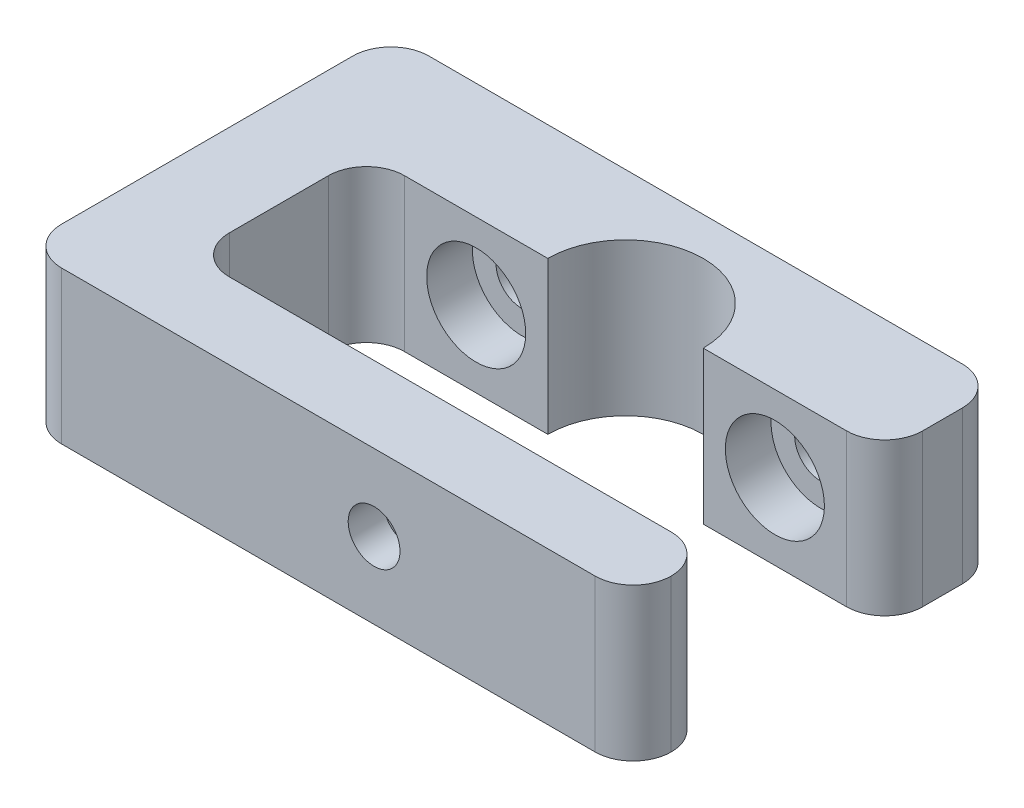
ISO-10303-21;
HEADER;
FILE_DESCRIPTION(('STEP AP214'),'2;1');
FILE_NAME('part.step','',(''),(''),'','','');
FILE_SCHEMA(('AUTOMOTIVE_DESIGN { 1 0 10303 214 1 1 1 1 }'));
ENDSEC;
DATA;
#1=APPLICATION_CONTEXT('core data for automotive mechanical design processes');
#2=APPLICATION_PROTOCOL_DEFINITION('international standard','automotive_design',2000,#1);
#3=PRODUCT_CONTEXT('',#1,'mechanical');
#4=PRODUCT('Part','Part','',(#3));
#5=PRODUCT_RELATED_PRODUCT_CATEGORY('part','',(#4));
#6=PRODUCT_DEFINITION_FORMATION('','',#4);
#7=PRODUCT_DEFINITION_CONTEXT('part definition',#1,'design');
#8=PRODUCT_DEFINITION('design','',#6,#7);
#9=PRODUCT_DEFINITION_SHAPE('','',#8);
#10=(LENGTH_UNIT() NAMED_UNIT(*) SI_UNIT(.MILLI.,.METRE.));
#11=(NAMED_UNIT(*) PLANE_ANGLE_UNIT() SI_UNIT($,.RADIAN.));
#12=(NAMED_UNIT(*) SI_UNIT($,.STERADIAN.) SOLID_ANGLE_UNIT());
#13=UNCERTAINTY_MEASURE_WITH_UNIT(LENGTH_MEASURE(1.E-05),#10,'distance_accuracy_value','');
#14=(GEOMETRIC_REPRESENTATION_CONTEXT(3) GLOBAL_UNCERTAINTY_ASSIGNED_CONTEXT((#13)) GLOBAL_UNIT_ASSIGNED_CONTEXT((#10,
#11,#12)) REPRESENTATION_CONTEXT('',''));
#15=CARTESIAN_POINT('',(0.,0.,0.));
#16=DIRECTION('',(0.,0.,1.));
#17=DIRECTION('',(1.,0.,0.));
#18=AXIS2_PLACEMENT_3D('',#15,#16,#17);
#19=CARTESIAN_POINT('',(0.,10.,0.));
#20=DIRECTION('',(0.,-1.,0.));
#21=DIRECTION('',(0.,0.,-1.));
#22=AXIS2_PLACEMENT_3D('',#19,#20,#21);
#23=CYLINDRICAL_SURFACE('',#22,5.1);
#24=CARTESIAN_POINT('',(0.,0.,0.));
#25=DIRECTION('',(0.,-1.,0.));
#26=DIRECTION('',(0.,0.,1.));
#27=AXIS2_PLACEMENT_3D('',#24,#25,#26);
#28=CIRCLE('',#27,5.1);
#29=CARTESIAN_POINT('',(-5.1,0.,0.));
#30=VERTEX_POINT('',#29);
#31=CARTESIAN_POINT('',(5.1,0.,0.));
#32=VERTEX_POINT('',#31);
#33=EDGE_CURVE('E277',#30,#32,#28,.T.);
#34=ORIENTED_EDGE('',*,*,#33,.T.);
#35=DIRECTION('',(0.,-1.,0.));
#36=VECTOR('',#35,1.);
#37=CARTESIAN_POINT('',(5.1,10.,0.));
#38=LINE('',#37,#36);
#39=CARTESIAN_POINT('',(5.1,10.,0.));
#40=VERTEX_POINT('',#39);
#41=EDGE_CURVE('E304',#40,#32,#38,.T.);
#42=ORIENTED_EDGE('',*,*,#41,.F.);
#43=CARTESIAN_POINT('',(0.,10.,0.));
#44=DIRECTION('',(0.,-1.,0.));
#45=DIRECTION('',(0.,0.,1.));
#46=AXIS2_PLACEMENT_3D('',#43,#44,#45);
#47=CIRCLE('',#46,5.1);
#48=CARTESIAN_POINT('',(-5.1,10.,0.));
#49=VERTEX_POINT('',#48);
#50=EDGE_CURVE('E250',#49,#40,#47,.T.);
#51=ORIENTED_EDGE('',*,*,#50,.F.);
#52=DIRECTION('',(0.,-1.,0.));
#53=VECTOR('',#52,1.);
#54=CARTESIAN_POINT('',(-5.1,10.,0.));
#55=LINE('',#54,#53);
#56=EDGE_CURVE('E276',#49,#30,#55,.T.);
#57=ORIENTED_EDGE('',*,*,#56,.T.);
#58=EDGE_LOOP('',(#34,#42,#51,#57));
#59=FACE_BOUND('',#58,.T.);
#60=ADVANCED_FACE('F37',(#59),#23,.F.);
#61=CARTESIAN_POINT('',(5.1,10.,0.));
#62=DIRECTION('',(0.,0.,-1.));
#63=DIRECTION('',(-1.,0.,0.));
#64=AXIS2_PLACEMENT_3D('',#61,#62,#63);
#65=PLANE('',#64);
#66=CARTESIAN_POINT('',(9.8,5.,0.));
#67=DIRECTION('',(0.,0.,1.));
#68=DIRECTION('',(1.,0.,0.));
#69=AXIS2_PLACEMENT_3D('',#66,#67,#68);
#70=CIRCLE('',#69,3.25);
#71=CARTESIAN_POINT('',(13.05,5.,0.));
#72=VERTEX_POINT('',#71);
#73=EDGE_CURVE('E823',#72,#72,#70,.T.);
#74=ORIENTED_EDGE('',*,*,#73,.F.);
#75=EDGE_LOOP('',(#74));
#76=FACE_BOUND('',#75,.T.);
#77=DIRECTION('',(1.,0.,0.));
#78=VECTOR('',#77,1.);
#79=CARTESIAN_POINT('',(5.1,0.,0.));
#80=LINE('',#79,#78);
#81=CARTESIAN_POINT('',(14.5,0.,0.));
#82=VERTEX_POINT('',#81);
#83=EDGE_CURVE('E280',#32,#82,#80,.T.);
#84=ORIENTED_EDGE('',*,*,#83,.T.);
#85=DIRECTION('',(0.,-1.,0.));
#86=VECTOR('',#85,1.);
#87=CARTESIAN_POINT('',(14.5,10.,0.));
#88=LINE('',#87,#86);
#89=CARTESIAN_POINT('',(14.5,10.,0.));
#90=VERTEX_POINT('',#89);
#91=EDGE_CURVE('E364',#82,#90,#88,.F.);
#92=ORIENTED_EDGE('',*,*,#91,.T.);
#93=DIRECTION('',(1.,0.,0.));
#94=VECTOR('',#93,1.);
#95=CARTESIAN_POINT('',(5.1,10.,0.));
#96=LINE('',#95,#94);
#97=EDGE_CURVE('E253',#40,#90,#96,.T.);
#98=ORIENTED_EDGE('',*,*,#97,.F.);
#99=ORIENTED_EDGE('',*,*,#41,.T.);
#100=EDGE_LOOP('',(#84,#92,#98,#99));
#101=FACE_BOUND('',#100,.T.);
#102=ADVANCED_FACE('F453',(#76,#101),#65,.F.);
#103=CARTESIAN_POINT('',(17.,10.,0.));
#104=DIRECTION('',(-1.,0.,0.));
#105=DIRECTION('',(0.,0.,1.));
#106=AXIS2_PLACEMENT_3D('',#103,#104,#105);
#107=PLANE('',#106);
#108=DIRECTION('',(0.,0.,-1.));
#109=VECTOR('',#108,1.);
#110=CARTESIAN_POINT('',(17.,10.,0.));
#111=LINE('',#110,#109);
#112=CARTESIAN_POINT('',(17.,10.,-2.5));
#113=VERTEX_POINT('',#112);
#114=CARTESIAN_POINT('',(17.,10.,-5.1));
#115=VERTEX_POINT('',#114);
#116=EDGE_CURVE('E257',#113,#115,#111,.T.);
#117=ORIENTED_EDGE('',*,*,#116,.F.);
#118=DIRECTION('',(0.,-1.,0.));
#119=VECTOR('',#118,1.);
#120=CARTESIAN_POINT('',(17.,10.,-2.5));
#121=LINE('',#120,#119);
#122=CARTESIAN_POINT('',(17.,0.,-2.5));
#123=VERTEX_POINT('',#122);
#124=EDGE_CURVE('E361',#113,#123,#121,.T.);
#125=ORIENTED_EDGE('',*,*,#124,.T.);
#126=DIRECTION('',(0.,0.,-1.));
#127=VECTOR('',#126,1.);
#128=CARTESIAN_POINT('',(17.,0.,0.));
#129=LINE('',#128,#127);
#130=CARTESIAN_POINT('',(17.,0.,-5.1));
#131=VERTEX_POINT('',#130);
#132=EDGE_CURVE('E283',#123,#131,#129,.T.);
#133=ORIENTED_EDGE('',*,*,#132,.T.);
#134=DIRECTION('',(0.,-1.,0.));
#135=VECTOR('',#134,1.);
#136=CARTESIAN_POINT('',(17.,10.,-5.1));
#137=LINE('',#136,#135);
#138=EDGE_CURVE('E359',#131,#115,#137,.F.);
#139=ORIENTED_EDGE('',*,*,#138,.T.);
#140=EDGE_LOOP('',(#117,#125,#133,#139));
#141=FACE_BOUND('',#140,.T.);
#142=ADVANCED_FACE('F409',(#141),#107,.F.);
#143=CARTESIAN_POINT('',(17.,10.,-7.6));
#144=DIRECTION('',(0.,0.,1.));
#145=DIRECTION('',(1.,0.,0.));
#146=AXIS2_PLACEMENT_3D('',#143,#144,#145);
#147=PLANE('',#146);
#148=CARTESIAN_POINT('',(-9.79999999999999,5.,-7.6));
#149=DIRECTION('',(0.,0.,1.));
#150=DIRECTION('',(1.,0.,0.));
#151=AXIS2_PLACEMENT_3D('',#148,#149,#150);
#152=CIRCLE('',#151,1.7);
#153=CARTESIAN_POINT('',(-8.1,5.,-7.6));
#154=VERTEX_POINT('',#153);
#155=EDGE_CURVE('E820',#154,#154,#152,.T.);
#156=ORIENTED_EDGE('',*,*,#155,.T.);
#157=EDGE_LOOP('',(#156));
#158=FACE_BOUND('',#157,.T.);
#159=CARTESIAN_POINT('',(9.8,5.,-7.6));
#160=DIRECTION('',(0.,0.,1.));
#161=DIRECTION('',(1.,0.,0.));
#162=AXIS2_PLACEMENT_3D('',#159,#160,#161);
#163=CIRCLE('',#162,1.7);
#164=CARTESIAN_POINT('',(11.5,5.,-7.6));
#165=VERTEX_POINT('',#164);
#166=EDGE_CURVE('E220',#165,#165,#163,.T.);
#167=ORIENTED_EDGE('',*,*,#166,.T.);
#168=EDGE_LOOP('',(#167));
#169=FACE_BOUND('',#168,.T.);
#170=DIRECTION('',(-1.,0.,0.));
#171=VECTOR('',#170,1.);
#172=CARTESIAN_POINT('',(17.,0.,-7.6));
#173=LINE('',#172,#171);
#174=CARTESIAN_POINT('',(14.5,0.,-7.6));
#175=VERTEX_POINT('',#174);
#176=CARTESIAN_POINT('',(-20.5,0.,-7.6));
#177=VERTEX_POINT('',#176);
#178=EDGE_CURVE('E286',#175,#177,#173,.T.);
#179=ORIENTED_EDGE('',*,*,#178,.T.);
#180=DIRECTION('',(0.,-1.,0.));
#181=VECTOR('',#180,1.);
#182=CARTESIAN_POINT('',(-20.5,10.,-7.6));
#183=LINE('',#182,#181);
#184=CARTESIAN_POINT('',(-20.5,10.,-7.6));
#185=VERTEX_POINT('',#184);
#186=EDGE_CURVE('E327',#177,#185,#183,.F.);
#187=ORIENTED_EDGE('',*,*,#186,.T.);
#188=DIRECTION('',(-1.,0.,0.));
#189=VECTOR('',#188,1.);
#190=CARTESIAN_POINT('',(17.,10.,-7.6));
#191=LINE('',#190,#189);
#192=CARTESIAN_POINT('',(14.5,10.,-7.6));
#193=VERTEX_POINT('',#192);
#194=EDGE_CURVE('E260',#193,#185,#191,.T.);
#195=ORIENTED_EDGE('',*,*,#194,.F.);
#196=DIRECTION('',(0.,-1.,0.));
#197=VECTOR('',#196,1.);
#198=CARTESIAN_POINT('',(14.5,10.,-7.6));
#199=LINE('',#198,#197);
#200=EDGE_CURVE('E324',#193,#175,#199,.T.);
#201=ORIENTED_EDGE('',*,*,#200,.T.);
#202=EDGE_LOOP('',(#179,#187,#195,#201));
#203=FACE_BOUND('',#202,.T.);
#204=ADVANCED_FACE('F417',(#158,#169,#203),#147,.F.);
#205=CARTESIAN_POINT('',(-23.,10.,16.5));
#206=DIRECTION('',(1.,0.,0.));
#207=DIRECTION('',(0.,0.,-1.));
#208=AXIS2_PLACEMENT_3D('',#205,#206,#207);
#209=PLANE('',#208);
#210=DIRECTION('',(0.,0.,1.));
#211=VECTOR('',#210,1.);
#212=CARTESIAN_POINT('',(-23.,10.,16.5));
#213=LINE('',#212,#211);
#214=CARTESIAN_POINT('',(-23.,10.,-5.1));
#215=VERTEX_POINT('',#214);
#216=CARTESIAN_POINT('',(-23.,10.,14.));
#217=VERTEX_POINT('',#216);
#218=EDGE_CURVE('E263',#215,#217,#213,.T.);
#219=ORIENTED_EDGE('',*,*,#218,.F.);
#220=DIRECTION('',(0.,-1.,0.));
#221=VECTOR('',#220,1.);
#222=CARTESIAN_POINT('',(-23.,10.,-5.1));
#223=LINE('',#222,#221);
#224=CARTESIAN_POINT('',(-23.,0.,-5.1));
#225=VERTEX_POINT('',#224);
#226=EDGE_CURVE('E309',#215,#225,#223,.T.);
#227=ORIENTED_EDGE('',*,*,#226,.T.);
#228=DIRECTION('',(0.,0.,1.));
#229=VECTOR('',#228,1.);
#230=CARTESIAN_POINT('',(-23.,0.,16.5));
#231=LINE('',#230,#229);
#232=CARTESIAN_POINT('',(-23.,0.,14.));
#233=VERTEX_POINT('',#232);
#234=EDGE_CURVE('E289',#225,#233,#231,.T.);
#235=ORIENTED_EDGE('',*,*,#234,.T.);
#236=DIRECTION('',(0.,-1.,0.));
#237=VECTOR('',#236,1.);
#238=CARTESIAN_POINT('',(-23.,10.,14.));
#239=LINE('',#238,#237);
#240=EDGE_CURVE('E307',#233,#217,#239,.F.);
#241=ORIENTED_EDGE('',*,*,#240,.T.);
#242=EDGE_LOOP('',(#219,#227,#235,#241));
#243=FACE_BOUND('',#242,.T.);
#244=ADVANCED_FACE('F425',(#243),#209,.F.);
#245=CARTESIAN_POINT('',(17.,10.,16.5));
#246=DIRECTION('',(0.,0.,-1.));
#247=DIRECTION('',(-1.,0.,0.));
#248=AXIS2_PLACEMENT_3D('',#245,#246,#247);
#249=PLANE('',#248);
#250=CARTESIAN_POINT('',(0.,5.,16.5));
#251=DIRECTION('',(0.,0.,-1.));
#252=DIRECTION('',(-1.,0.,0.));
#253=AXIS2_PLACEMENT_3D('',#250,#251,#252);
#254=CIRCLE('',#253,1.7);
#255=CARTESIAN_POINT('',(-1.7,5.,16.5));
#256=VERTEX_POINT('',#255);
#257=EDGE_CURVE('E804',#256,#256,#254,.T.);
#258=ORIENTED_EDGE('',*,*,#257,.T.);
#259=EDGE_LOOP('',(#258));
#260=FACE_BOUND('',#259,.T.);
#261=DIRECTION('',(1.,0.,0.));
#262=VECTOR('',#261,1.);
#263=CARTESIAN_POINT('',(17.,10.,16.5));
#264=LINE('',#263,#262);
#265=CARTESIAN_POINT('',(-20.5,10.,16.5));
#266=VERTEX_POINT('',#265);
#267=CARTESIAN_POINT('',(14.5,10.,16.5));
#268=VERTEX_POINT('',#267);
#269=EDGE_CURVE('E266',#266,#268,#264,.T.);
#270=ORIENTED_EDGE('',*,*,#269,.F.);
#271=DIRECTION('',(0.,-1.,0.));
#272=VECTOR('',#271,1.);
#273=CARTESIAN_POINT('',(-20.5,10.,16.5));
#274=LINE('',#273,#272);
#275=CARTESIAN_POINT('',(-20.5,0.,16.5));
#276=VERTEX_POINT('',#275);
#277=EDGE_CURVE('E356',#266,#276,#274,.T.);
#278=ORIENTED_EDGE('',*,*,#277,.T.);
#279=DIRECTION('',(1.,0.,0.));
#280=VECTOR('',#279,1.);
#281=CARTESIAN_POINT('',(17.,0.,16.5));
#282=LINE('',#281,#280);
#283=CARTESIAN_POINT('',(14.5,0.,16.5));
#284=VERTEX_POINT('',#283);
#285=EDGE_CURVE('E292',#276,#284,#282,.T.);
#286=ORIENTED_EDGE('',*,*,#285,.T.);
#287=DIRECTION('',(0.,-1.,0.));
#288=VECTOR('',#287,1.);
#289=CARTESIAN_POINT('',(14.5,10.,16.5));
#290=LINE('',#289,#288);
#291=EDGE_CURVE('E353',#284,#268,#290,.F.);
#292=ORIENTED_EDGE('',*,*,#291,.T.);
#293=EDGE_LOOP('',(#270,#278,#286,#292));
#294=FACE_BOUND('',#293,.T.);
#295=ADVANCED_FACE('F434',(#260,#294),#249,.F.);
#296=CARTESIAN_POINT('',(-17.,10.,11.5));
#297=DIRECTION('',(0.,0.,1.));
#298=DIRECTION('',(1.,0.,0.));
#299=AXIS2_PLACEMENT_3D('',#296,#297,#298);
#300=PLANE('',#299);
#301=DIRECTION('',(0.5,0.866025403784439,0.));
#302=VECTOR('',#301,1.);
#303=CARTESIAN_POINT('',(-3.3,5.,11.5));
#304=LINE('',#303,#302);
#305=CARTESIAN_POINT('',(-3.3,5.,11.5));
#306=VERTEX_POINT('',#305);
#307=CARTESIAN_POINT('',(-1.65,7.85788383248865,11.5));
#308=VERTEX_POINT('',#307);
#309=EDGE_CURVE('E231',#306,#308,#304,.T.);
#310=ORIENTED_EDGE('',*,*,#309,.F.);
#311=DIRECTION('',(-0.5,0.866025403784439,0.));
#312=VECTOR('',#311,1.);
#313=CARTESIAN_POINT('',(-1.65,2.14211616751135,11.5));
#314=LINE('',#313,#312);
#315=CARTESIAN_POINT('',(-1.65,2.14211616751135,11.5));
#316=VERTEX_POINT('',#315);
#317=EDGE_CURVE('E53',#316,#306,#314,.T.);
#318=ORIENTED_EDGE('',*,*,#317,.F.);
#319=DIRECTION('',(-1.,0.,0.));
#320=VECTOR('',#319,1.);
#321=CARTESIAN_POINT('',(1.65,2.14211616751135,11.5));
#322=LINE('',#321,#320);
#323=CARTESIAN_POINT('',(1.65,2.14211616751135,11.5));
#324=VERTEX_POINT('',#323);
#325=EDGE_CURVE('E214',#324,#316,#322,.T.);
#326=ORIENTED_EDGE('',*,*,#325,.F.);
#327=DIRECTION('',(-0.5,-0.866025403784439,0.));
#328=VECTOR('',#327,1.);
#329=CARTESIAN_POINT('',(3.3,5.,11.5));
#330=LINE('',#329,#328);
#331=CARTESIAN_POINT('',(3.3,5.,11.5));
#332=VERTEX_POINT('',#331);
#333=EDGE_CURVE('E217',#332,#324,#330,.T.);
#334=ORIENTED_EDGE('',*,*,#333,.F.);
#335=DIRECTION('',(0.5,-0.866025403784439,0.));
#336=VECTOR('',#335,1.);
#337=CARTESIAN_POINT('',(1.65,7.85788383248865,11.5));
#338=LINE('',#337,#336);
#339=CARTESIAN_POINT('',(1.65,7.85788383248865,11.5));
#340=VERTEX_POINT('',#339);
#341=EDGE_CURVE('E236',#340,#332,#338,.T.);
#342=ORIENTED_EDGE('',*,*,#341,.F.);
#343=DIRECTION('',(1.,0.,0.));
#344=VECTOR('',#343,1.);
#345=CARTESIAN_POINT('',(-1.65,7.85788383248865,11.5));
#346=LINE('',#345,#344);
#347=EDGE_CURVE('E233',#308,#340,#346,.T.);
#348=ORIENTED_EDGE('',*,*,#347,.F.);
#349=EDGE_LOOP('',(#310,#318,#326,#334,#342,#348));
#350=FACE_BOUND('',#349,.T.);
#351=DIRECTION('',(-1.,0.,0.));
#352=VECTOR('',#351,1.);
#353=CARTESIAN_POINT('',(-17.,0.,11.5));
#354=LINE('',#353,#352);
#355=CARTESIAN_POINT('',(14.5,0.,11.5));
#356=VERTEX_POINT('',#355);
#357=CARTESIAN_POINT('',(-14.5,0.,11.5));
#358=VERTEX_POINT('',#357);
#359=EDGE_CURVE('E295',#356,#358,#354,.T.);
#360=ORIENTED_EDGE('',*,*,#359,.T.);
#361=DIRECTION('',(0.,-1.,0.));
#362=VECTOR('',#361,1.);
#363=CARTESIAN_POINT('',(-14.5,10.,11.5));
#364=LINE('',#363,#362);
#365=CARTESIAN_POINT('',(-14.5,10.,11.5));
#366=VERTEX_POINT('',#365);
#367=EDGE_CURVE('E351',#358,#366,#364,.F.);
#368=ORIENTED_EDGE('',*,*,#367,.T.);
#369=DIRECTION('',(-1.,0.,0.));
#370=VECTOR('',#369,1.);
#371=CARTESIAN_POINT('',(-17.,10.,11.5));
#372=LINE('',#371,#370);
#373=CARTESIAN_POINT('',(14.5,10.,11.5));
#374=VERTEX_POINT('',#373);
#375=EDGE_CURVE('E269',#374,#366,#372,.T.);
#376=ORIENTED_EDGE('',*,*,#375,.F.);
#377=DIRECTION('',(0.,-1.,0.));
#378=VECTOR('',#377,1.);
#379=CARTESIAN_POINT('',(14.5,10.,11.5));
#380=LINE('',#379,#378);
#381=EDGE_CURVE('E349',#374,#356,#380,.T.);
#382=ORIENTED_EDGE('',*,*,#381,.T.);
#383=EDGE_LOOP('',(#360,#368,#376,#382));
#384=FACE_BOUND('',#383,.T.);
#385=ADVANCED_FACE('F379',(#350,#384),#300,.F.);
#386=CARTESIAN_POINT('',(-17.,10.,0.));
#387=DIRECTION('',(-1.,0.,0.));
#388=DIRECTION('',(0.,0.,1.));
#389=AXIS2_PLACEMENT_3D('',#386,#387,#388);
#390=PLANE('',#389);
#391=DIRECTION('',(0.,0.,-1.));
#392=VECTOR('',#391,1.);
#393=CARTESIAN_POINT('',(-17.,0.,0.));
#394=LINE('',#393,#392);
#395=CARTESIAN_POINT('',(-17.,0.,9.));
#396=VERTEX_POINT('',#395);
#397=CARTESIAN_POINT('',(-17.,0.,2.5));
#398=VERTEX_POINT('',#397);
#399=EDGE_CURVE('E298',#396,#398,#394,.T.);
#400=ORIENTED_EDGE('',*,*,#399,.T.);
#401=DIRECTION('',(0.,-1.,0.));
#402=VECTOR('',#401,1.);
#403=CARTESIAN_POINT('',(-17.,10.,2.5));
#404=LINE('',#403,#402);
#405=CARTESIAN_POINT('',(-17.,10.,2.5));
#406=VERTEX_POINT('',#405);
#407=EDGE_CURVE('E347',#398,#406,#404,.F.);
#408=ORIENTED_EDGE('',*,*,#407,.T.);
#409=DIRECTION('',(0.,0.,-1.));
#410=VECTOR('',#409,1.);
#411=CARTESIAN_POINT('',(-17.,10.,0.));
#412=LINE('',#411,#410);
#413=CARTESIAN_POINT('',(-17.,10.,9.));
#414=VERTEX_POINT('',#413);
#415=EDGE_CURVE('E272',#414,#406,#412,.T.);
#416=ORIENTED_EDGE('',*,*,#415,.F.);
#417=DIRECTION('',(0.,-1.,0.));
#418=VECTOR('',#417,1.);
#419=CARTESIAN_POINT('',(-17.,0.,9.));
#420=LINE('',#419,#418);
#421=EDGE_CURVE('E344',#414,#396,#420,.T.);
#422=ORIENTED_EDGE('',*,*,#421,.T.);
#423=EDGE_LOOP('',(#400,#408,#416,#422));
#424=FACE_BOUND('',#423,.T.);
#425=ADVANCED_FACE('F387',(#424),#390,.F.);
#426=CARTESIAN_POINT('',(-5.1,10.,0.));
#427=DIRECTION('',(0.,0.,-1.));
#428=DIRECTION('',(-1.,0.,0.));
#429=AXIS2_PLACEMENT_3D('',#426,#427,#428);
#430=PLANE('',#429);
#431=CARTESIAN_POINT('',(-9.79999999999999,5.,0.));
#432=DIRECTION('',(0.,0.,1.));
#433=DIRECTION('',(1.,0.,0.));
#434=AXIS2_PLACEMENT_3D('',#431,#432,#433);
#435=CIRCLE('',#434,3.25);
#436=CARTESIAN_POINT('',(-6.55,5.,0.));
#437=VERTEX_POINT('',#436);
#438=EDGE_CURVE('E809',#437,#437,#435,.T.);
#439=ORIENTED_EDGE('',*,*,#438,.F.);
#440=EDGE_LOOP('',(#439));
#441=FACE_BOUND('',#440,.T.);
#442=DIRECTION('',(1.,0.,0.));
#443=VECTOR('',#442,1.);
#444=CARTESIAN_POINT('',(-5.1,10.,0.));
#445=LINE('',#444,#443);
#446=CARTESIAN_POINT('',(-14.5,10.,0.));
#447=VERTEX_POINT('',#446);
#448=EDGE_CURVE('E274',#447,#49,#445,.T.);
#449=ORIENTED_EDGE('',*,*,#448,.F.);
#450=DIRECTION('',(0.,-1.,0.));
#451=VECTOR('',#450,1.);
#452=CARTESIAN_POINT('',(-14.5,0.,0.));
#453=LINE('',#452,#451);
#454=CARTESIAN_POINT('',(-14.5,0.,0.));
#455=VERTEX_POINT('',#454);
#456=EDGE_CURVE('E341',#447,#455,#453,.T.);
#457=ORIENTED_EDGE('',*,*,#456,.T.);
#458=DIRECTION('',(1.,0.,0.));
#459=VECTOR('',#458,1.);
#460=CARTESIAN_POINT('',(-5.1,0.,0.));
#461=LINE('',#460,#459);
#462=EDGE_CURVE('E254',#455,#30,#461,.T.);
#463=ORIENTED_EDGE('',*,*,#462,.T.);
#464=ORIENTED_EDGE('',*,*,#56,.F.);
#465=EDGE_LOOP('',(#449,#457,#463,#464));
#466=FACE_BOUND('',#465,.T.);
#467=ADVANCED_FACE('F394',(#441,#466),#430,.F.);
#468=CARTESIAN_POINT('',(0.,10.,0.));
#469=DIRECTION('',(0.,1.,0.));
#470=DIRECTION('',(0.,0.,1.));
#471=AXIS2_PLACEMENT_3D('',#468,#469,#470);
#472=PLANE('',#471);
#473=ORIENTED_EDGE('',*,*,#194,.T.);
#474=CARTESIAN_POINT('',(-20.5,10.,-5.1));
#475=DIRECTION('',(0.,1.,0.));
#476=DIRECTION('',(0.,0.,1.));
#477=AXIS2_PLACEMENT_3D('',#474,#475,#476);
#478=CIRCLE('',#477,2.5);
#479=EDGE_CURVE('E339',#185,#215,#478,.T.);
#480=ORIENTED_EDGE('',*,*,#479,.T.);
#481=ORIENTED_EDGE('',*,*,#218,.T.);
#482=CARTESIAN_POINT('',(-20.5,10.,14.));
#483=DIRECTION('',(0.,1.,0.));
#484=DIRECTION('',(0.,0.,1.));
#485=AXIS2_PLACEMENT_3D('',#482,#483,#484);
#486=CIRCLE('',#485,2.5);
#487=EDGE_CURVE('E337',#217,#266,#486,.T.);
#488=ORIENTED_EDGE('',*,*,#487,.T.);
#489=ORIENTED_EDGE('',*,*,#269,.T.);
#490=CARTESIAN_POINT('',(14.5,10.,14.));
#491=DIRECTION('',(0.,1.,0.));
#492=DIRECTION('',(0.,0.,1.));
#493=AXIS2_PLACEMENT_3D('',#490,#491,#492);
#494=CIRCLE('',#493,2.5);
#495=CARTESIAN_POINT('',(17.,10.,14.));
#496=VERTEX_POINT('',#495);
#497=EDGE_CURVE('E335',#268,#496,#494,.T.);
#498=ORIENTED_EDGE('',*,*,#497,.T.);
#499=CARTESIAN_POINT('',(14.5,10.,14.));
#500=DIRECTION('',(0.,1.,0.));
#501=DIRECTION('',(0.,0.,1.));
#502=AXIS2_PLACEMENT_3D('',#499,#500,#501);
#503=CIRCLE('',#502,2.5);
#504=EDGE_CURVE('E333',#496,#374,#503,.T.);
#505=ORIENTED_EDGE('',*,*,#504,.T.);
#506=ORIENTED_EDGE('',*,*,#375,.T.);
#507=CARTESIAN_POINT('',(-14.5,10.,9.));
#508=DIRECTION('',(0.,1.,0.));
#509=DIRECTION('',(0.,0.,1.));
#510=AXIS2_PLACEMENT_3D('',#507,#508,#509);
#511=CIRCLE('',#510,2.5);
#512=EDGE_CURVE('E11',#366,#414,#511,.F.);
#513=ORIENTED_EDGE('',*,*,#512,.T.);
#514=ORIENTED_EDGE('',*,*,#415,.T.);
#515=CARTESIAN_POINT('',(-14.5,10.,2.5));
#516=DIRECTION('',(0.,1.,0.));
#517=DIRECTION('',(0.,0.,1.));
#518=AXIS2_PLACEMENT_3D('',#515,#516,#517);
#519=CIRCLE('',#518,2.5);
#520=EDGE_CURVE('E61',#406,#447,#519,.F.);
#521=ORIENTED_EDGE('',*,*,#520,.T.);
#522=ORIENTED_EDGE('',*,*,#448,.T.);
#523=ORIENTED_EDGE('',*,*,#50,.T.);
#524=ORIENTED_EDGE('',*,*,#97,.T.);
#525=CARTESIAN_POINT('',(14.5,10.,-2.5));
#526=DIRECTION('',(0.,1.,0.));
#527=DIRECTION('',(0.,0.,1.));
#528=AXIS2_PLACEMENT_3D('',#525,#526,#527);
#529=CIRCLE('',#528,2.5);
#530=EDGE_CURVE('E331',#90,#113,#529,.T.);
#531=ORIENTED_EDGE('',*,*,#530,.T.);
#532=ORIENTED_EDGE('',*,*,#116,.T.);
#533=CARTESIAN_POINT('',(14.5,10.,-5.1));
#534=DIRECTION('',(0.,1.,0.));
#535=DIRECTION('',(0.,0.,1.));
#536=AXIS2_PLACEMENT_3D('',#533,#534,#535);
#537=CIRCLE('',#536,2.5);
#538=EDGE_CURVE('E329',#115,#193,#537,.T.);
#539=ORIENTED_EDGE('',*,*,#538,.T.);
#540=EDGE_LOOP('',(#473,#480,#481,#488,#489,#498,#505,#506,#513,#514,#521,#522,#523,#524,#531,
#532,#539));
#541=FACE_BOUND('',#540,.T.);
#542=ADVANCED_FACE('F385',(#541),#472,.T.);
#543=CARTESIAN_POINT('',(0.,0.,0.));
#544=DIRECTION('',(0.,1.,0.));
#545=DIRECTION('',(0.,0.,1.));
#546=AXIS2_PLACEMENT_3D('',#543,#544,#545);
#547=PLANE('',#546);
#548=ORIENTED_EDGE('',*,*,#234,.F.);
#549=CARTESIAN_POINT('',(-20.5,0.,-5.1));
#550=DIRECTION('',(0.,1.,0.));
#551=DIRECTION('',(0.,0.,1.));
#552=AXIS2_PLACEMENT_3D('',#549,#550,#551);
#553=CIRCLE('',#552,2.5);
#554=EDGE_CURVE('E322',#225,#177,#553,.F.);
#555=ORIENTED_EDGE('',*,*,#554,.T.);
#556=ORIENTED_EDGE('',*,*,#178,.F.);
#557=CARTESIAN_POINT('',(14.5,0.,-5.1));
#558=DIRECTION('',(0.,1.,0.));
#559=DIRECTION('',(0.,0.,1.));
#560=AXIS2_PLACEMENT_3D('',#557,#558,#559);
#561=CIRCLE('',#560,2.5);
#562=EDGE_CURVE('E312',#175,#131,#561,.F.);
#563=ORIENTED_EDGE('',*,*,#562,.T.);
#564=ORIENTED_EDGE('',*,*,#132,.F.);
#565=CARTESIAN_POINT('',(14.5,0.,-2.5));
#566=DIRECTION('',(0.,1.,0.));
#567=DIRECTION('',(0.,0.,1.));
#568=AXIS2_PLACEMENT_3D('',#565,#566,#567);
#569=CIRCLE('',#568,2.5);
#570=EDGE_CURVE('E314',#123,#82,#569,.F.);
#571=ORIENTED_EDGE('',*,*,#570,.T.);
#572=ORIENTED_EDGE('',*,*,#83,.F.);
#573=ORIENTED_EDGE('',*,*,#33,.F.);
#574=ORIENTED_EDGE('',*,*,#462,.F.);
#575=CARTESIAN_POINT('',(-14.5,0.,2.5));
#576=DIRECTION('',(0.,1.,0.));
#577=DIRECTION('',(0.,0.,1.));
#578=AXIS2_PLACEMENT_3D('',#575,#576,#577);
#579=CIRCLE('',#578,2.5);
#580=EDGE_CURVE('E366',#455,#398,#579,.T.);
#581=ORIENTED_EDGE('',*,*,#580,.T.);
#582=ORIENTED_EDGE('',*,*,#399,.F.);
#583=CARTESIAN_POINT('',(-14.5,0.,9.));
#584=DIRECTION('',(0.,1.,0.));
#585=DIRECTION('',(0.,0.,1.));
#586=AXIS2_PLACEMENT_3D('',#583,#584,#585);
#587=CIRCLE('',#586,2.5);
#588=EDGE_CURVE('E46',#396,#358,#587,.T.);
#589=ORIENTED_EDGE('',*,*,#588,.T.);
#590=ORIENTED_EDGE('',*,*,#359,.F.);
#591=CARTESIAN_POINT('',(14.5,0.,14.));
#592=DIRECTION('',(0.,1.,0.));
#593=DIRECTION('',(0.,0.,1.));
#594=AXIS2_PLACEMENT_3D('',#591,#592,#593);
#595=CIRCLE('',#594,2.5);
#596=CARTESIAN_POINT('',(17.,0.,14.));
#597=VERTEX_POINT('',#596);
#598=EDGE_CURVE('E316',#356,#597,#595,.F.);
#599=ORIENTED_EDGE('',*,*,#598,.T.);
#600=CARTESIAN_POINT('',(14.5,0.,14.));
#601=DIRECTION('',(0.,1.,0.));
#602=DIRECTION('',(0.,0.,1.));
#603=AXIS2_PLACEMENT_3D('',#600,#601,#602);
#604=CIRCLE('',#603,2.5);
#605=EDGE_CURVE('E318',#597,#284,#604,.F.);
#606=ORIENTED_EDGE('',*,*,#605,.T.);
#607=ORIENTED_EDGE('',*,*,#285,.F.);
#608=CARTESIAN_POINT('',(-20.5,0.,14.));
#609=DIRECTION('',(0.,1.,0.));
#610=DIRECTION('',(0.,0.,1.));
#611=AXIS2_PLACEMENT_3D('',#608,#609,#610);
#612=CIRCLE('',#611,2.5);
#613=EDGE_CURVE('E320',#276,#233,#612,.F.);
#614=ORIENTED_EDGE('',*,*,#613,.T.);
#615=EDGE_LOOP('',(#548,#555,#556,#563,#564,#571,#572,#573,#574,#581,#582,#589,#590,#599,#606,
#607,#614));
#616=FACE_BOUND('',#615,.T.);
#617=ADVANCED_FACE('F373',(#616),#547,.F.);
#618=CARTESIAN_POINT('',(-20.5,10.,-5.1));
#619=DIRECTION('',(0.,-1.,0.));
#620=DIRECTION('',(0.,0.,-1.));
#621=AXIS2_PLACEMENT_3D('',#618,#619,#620);
#622=CYLINDRICAL_SURFACE('',#621,2.5);
#623=ORIENTED_EDGE('',*,*,#479,.F.);
#624=ORIENTED_EDGE('',*,*,#186,.F.);
#625=ORIENTED_EDGE('',*,*,#554,.F.);
#626=ORIENTED_EDGE('',*,*,#226,.F.);
#627=EDGE_LOOP('',(#623,#624,#625,#626));
#628=FACE_BOUND('',#627,.T.);
#629=ADVANCED_FACE('F423',(#628),#622,.T.);
#630=CARTESIAN_POINT('',(-14.5,10.,2.5));
#631=DIRECTION('',(0.,1.,0.));
#632=DIRECTION('',(0.,0.,1.));
#633=AXIS2_PLACEMENT_3D('',#630,#631,#632);
#634=CYLINDRICAL_SURFACE('',#633,2.5);
#635=ORIENTED_EDGE('',*,*,#520,.F.);
#636=ORIENTED_EDGE('',*,*,#407,.F.);
#637=ORIENTED_EDGE('',*,*,#580,.F.);
#638=ORIENTED_EDGE('',*,*,#456,.F.);
#639=EDGE_LOOP('',(#635,#636,#637,#638));
#640=FACE_BOUND('',#639,.T.);
#641=ADVANCED_FACE('F390',(#640),#634,.F.);
#642=CARTESIAN_POINT('',(-14.5,10.,9.));
#643=DIRECTION('',(0.,1.,0.));
#644=DIRECTION('',(0.,0.,1.));
#645=AXIS2_PLACEMENT_3D('',#642,#643,#644);
#646=CYLINDRICAL_SURFACE('',#645,2.5);
#647=ORIENTED_EDGE('',*,*,#512,.F.);
#648=ORIENTED_EDGE('',*,*,#367,.F.);
#649=ORIENTED_EDGE('',*,*,#588,.F.);
#650=ORIENTED_EDGE('',*,*,#421,.F.);
#651=EDGE_LOOP('',(#647,#648,#649,#650));
#652=FACE_BOUND('',#651,.T.);
#653=ADVANCED_FACE('F383',(#652),#646,.F.);
#654=CARTESIAN_POINT('',(-20.5,10.,14.));
#655=DIRECTION('',(0.,-1.,0.));
#656=DIRECTION('',(0.,0.,-1.));
#657=AXIS2_PLACEMENT_3D('',#654,#655,#656);
#658=CYLINDRICAL_SURFACE('',#657,2.5);
#659=ORIENTED_EDGE('',*,*,#487,.F.);
#660=ORIENTED_EDGE('',*,*,#240,.F.);
#661=ORIENTED_EDGE('',*,*,#613,.F.);
#662=ORIENTED_EDGE('',*,*,#277,.F.);
#663=EDGE_LOOP('',(#659,#660,#661,#662));
#664=FACE_BOUND('',#663,.T.);
#665=ADVANCED_FACE('F431',(#664),#658,.T.);
#666=CARTESIAN_POINT('',(14.5,10.,14.));
#667=DIRECTION('',(0.,-1.,0.));
#668=DIRECTION('',(0.,0.,-1.));
#669=AXIS2_PLACEMENT_3D('',#666,#667,#668);
#670=CYLINDRICAL_SURFACE('',#669,2.5);
#671=ORIENTED_EDGE('',*,*,#381,.F.);
#672=ORIENTED_EDGE('',*,*,#504,.F.);
#673=DIRECTION('',(0.,-1.,0.));
#674=VECTOR('',#673,1.);
#675=CARTESIAN_POINT('',(17.,10.,14.));
#676=LINE('',#675,#674);
#677=EDGE_CURVE('E41',#597,#496,#676,.F.);
#678=ORIENTED_EDGE('',*,*,#677,.F.);
#679=ORIENTED_EDGE('',*,*,#598,.F.);
#680=EDGE_LOOP('',(#671,#672,#678,#679));
#681=FACE_BOUND('',#680,.T.);
#682=ADVANCED_FACE('F441',(#681),#670,.T.);
#683=CARTESIAN_POINT('',(14.5,10.,14.));
#684=DIRECTION('',(0.,-1.,0.));
#685=DIRECTION('',(0.,0.,-1.));
#686=AXIS2_PLACEMENT_3D('',#683,#684,#685);
#687=CYLINDRICAL_SURFACE('',#686,2.5);
#688=ORIENTED_EDGE('',*,*,#497,.F.);
#689=ORIENTED_EDGE('',*,*,#291,.F.);
#690=ORIENTED_EDGE('',*,*,#605,.F.);
#691=ORIENTED_EDGE('',*,*,#677,.T.);
#692=EDGE_LOOP('',(#688,#689,#690,#691));
#693=FACE_BOUND('',#692,.T.);
#694=ADVANCED_FACE('F443',(#693),#687,.T.);
#695=CARTESIAN_POINT('',(14.5,10.,-2.5));
#696=DIRECTION('',(0.,-1.,0.));
#697=DIRECTION('',(0.,0.,-1.));
#698=AXIS2_PLACEMENT_3D('',#695,#696,#697);
#699=CYLINDRICAL_SURFACE('',#698,2.5);
#700=ORIENTED_EDGE('',*,*,#530,.F.);
#701=ORIENTED_EDGE('',*,*,#91,.F.);
#702=ORIENTED_EDGE('',*,*,#570,.F.);
#703=ORIENTED_EDGE('',*,*,#124,.F.);
#704=EDGE_LOOP('',(#700,#701,#702,#703));
#705=FACE_BOUND('',#704,.T.);
#706=ADVANCED_FACE('F406',(#705),#699,.T.);
#707=CARTESIAN_POINT('',(14.5,10.,-5.1));
#708=DIRECTION('',(0.,-1.,0.));
#709=DIRECTION('',(0.,0.,-1.));
#710=AXIS2_PLACEMENT_3D('',#707,#708,#709);
#711=CYLINDRICAL_SURFACE('',#710,2.5);
#712=ORIENTED_EDGE('',*,*,#538,.F.);
#713=ORIENTED_EDGE('',*,*,#138,.F.);
#714=ORIENTED_EDGE('',*,*,#562,.F.);
#715=ORIENTED_EDGE('',*,*,#200,.F.);
#716=EDGE_LOOP('',(#712,#713,#714,#715));
#717=FACE_BOUND('',#716,.T.);
#718=ADVANCED_FACE('F39',(#717),#711,.T.);
#719=CARTESIAN_POINT('',(-1.65,2.14211616751135,14.2));
#720=DIRECTION('',(-0.866025403784439,-0.5,0.));
#721=DIRECTION('',(0.5,-0.866025403784439,0.));
#722=AXIS2_PLACEMENT_3D('',#719,#720,#721);
#723=PLANE('',#722);
#724=ORIENTED_EDGE('',*,*,#317,.T.);
#725=DIRECTION('',(0.,0.,-1.));
#726=VECTOR('',#725,1.);
#727=CARTESIAN_POINT('',(-3.3,5.,14.2));
#728=LINE('',#727,#726);
#729=CARTESIAN_POINT('',(-3.3,5.,14.2));
#730=VERTEX_POINT('',#729);
#731=EDGE_CURVE('E191',#730,#306,#728,.T.);
#732=ORIENTED_EDGE('',*,*,#731,.F.);
#733=DIRECTION('',(-0.5,0.866025403784439,0.));
#734=VECTOR('',#733,1.);
#735=CARTESIAN_POINT('',(-1.65,2.14211616751135,14.2));
#736=LINE('',#735,#734);
#737=CARTESIAN_POINT('',(-1.65,2.14211616751135,14.2));
#738=VERTEX_POINT('',#737);
#739=EDGE_CURVE('E195',#738,#730,#736,.T.);
#740=ORIENTED_EDGE('',*,*,#739,.F.);
#741=DIRECTION('',(0.,0.,-1.));
#742=VECTOR('',#741,1.);
#743=CARTESIAN_POINT('',(-1.65,2.14211616751135,14.2));
#744=LINE('',#743,#742);
#745=EDGE_CURVE('E241',#738,#316,#744,.T.);
#746=ORIENTED_EDGE('',*,*,#745,.T.);
#747=EDGE_LOOP('',(#724,#732,#740,#746));
#748=FACE_BOUND('',#747,.T.);
#749=ADVANCED_FACE('F193',(#748),#723,.F.);
#750=CARTESIAN_POINT('',(1.65,2.14211616751135,14.2));
#751=DIRECTION('',(0.,-1.,0.));
#752=DIRECTION('',(0.,0.,-1.));
#753=AXIS2_PLACEMENT_3D('',#750,#751,#752);
#754=PLANE('',#753);
#755=ORIENTED_EDGE('',*,*,#325,.T.);
#756=ORIENTED_EDGE('',*,*,#745,.F.);
#757=DIRECTION('',(-1.,0.,0.));
#758=VECTOR('',#757,1.);
#759=CARTESIAN_POINT('',(1.65,2.14211616751135,14.2));
#760=LINE('',#759,#758);
#761=CARTESIAN_POINT('',(1.65,2.14211616751135,14.2));
#762=VERTEX_POINT('',#761);
#763=EDGE_CURVE('E201',#762,#738,#760,.T.);
#764=ORIENTED_EDGE('',*,*,#763,.F.);
#765=DIRECTION('',(0.,0.,-1.));
#766=VECTOR('',#765,1.);
#767=CARTESIAN_POINT('',(1.65,2.14211616751135,14.2));
#768=LINE('',#767,#766);
#769=EDGE_CURVE('E243',#762,#324,#768,.T.);
#770=ORIENTED_EDGE('',*,*,#769,.T.);
#771=EDGE_LOOP('',(#755,#756,#764,#770));
#772=FACE_BOUND('',#771,.T.);
#773=ADVANCED_FACE('F520',(#772),#754,.F.);
#774=CARTESIAN_POINT('',(3.3,5.,14.2));
#775=DIRECTION('',(0.866025403784438,-0.5,0.));
#776=DIRECTION('',(0.5,0.866025403784439,0.));
#777=AXIS2_PLACEMENT_3D('',#774,#775,#776);
#778=PLANE('',#777);
#779=ORIENTED_EDGE('',*,*,#333,.T.);
#780=ORIENTED_EDGE('',*,*,#769,.F.);
#781=DIRECTION('',(-0.5,-0.866025403784439,0.));
#782=VECTOR('',#781,1.);
#783=CARTESIAN_POINT('',(3.3,5.,14.2));
#784=LINE('',#783,#782);
#785=CARTESIAN_POINT('',(3.3,5.,14.2));
#786=VERTEX_POINT('',#785);
#787=EDGE_CURVE('E227',#786,#762,#784,.T.);
#788=ORIENTED_EDGE('',*,*,#787,.F.);
#789=DIRECTION('',(0.,0.,-1.));
#790=VECTOR('',#789,1.);
#791=CARTESIAN_POINT('',(3.3,5.,14.2));
#792=LINE('',#791,#790);
#793=EDGE_CURVE('E245',#786,#332,#792,.T.);
#794=ORIENTED_EDGE('',*,*,#793,.T.);
#795=EDGE_LOOP('',(#779,#780,#788,#794));
#796=FACE_BOUND('',#795,.T.);
#797=ADVANCED_FACE('F530',(#796),#778,.F.);
#798=CARTESIAN_POINT('',(1.65,7.85788383248865,14.2));
#799=DIRECTION('',(0.866025403784439,0.5,0.));
#800=DIRECTION('',(-0.5,0.866025403784439,0.));
#801=AXIS2_PLACEMENT_3D('',#798,#799,#800);
#802=PLANE('',#801);
#803=ORIENTED_EDGE('',*,*,#341,.T.);
#804=ORIENTED_EDGE('',*,*,#793,.F.);
#805=DIRECTION('',(0.5,-0.866025403784439,0.));
#806=VECTOR('',#805,1.);
#807=CARTESIAN_POINT('',(1.65,7.85788383248865,14.2));
#808=LINE('',#807,#806);
#809=CARTESIAN_POINT('',(1.65,7.85788383248865,14.2));
#810=VERTEX_POINT('',#809);
#811=EDGE_CURVE('E224',#810,#786,#808,.T.);
#812=ORIENTED_EDGE('',*,*,#811,.F.);
#813=DIRECTION('',(0.,0.,-1.));
#814=VECTOR('',#813,1.);
#815=CARTESIAN_POINT('',(1.65,7.85788383248865,14.2));
#816=LINE('',#815,#814);
#817=EDGE_CURVE('E247',#810,#340,#816,.T.);
#818=ORIENTED_EDGE('',*,*,#817,.T.);
#819=EDGE_LOOP('',(#803,#804,#812,#818));
#820=FACE_BOUND('',#819,.T.);
#821=ADVANCED_FACE('F541',(#820),#802,.F.);
#822=CARTESIAN_POINT('',(-1.65,7.85788383248865,14.2));
#823=DIRECTION('',(0.,1.,0.));
#824=DIRECTION('',(0.,0.,1.));
#825=AXIS2_PLACEMENT_3D('',#822,#823,#824);
#826=PLANE('',#825);
#827=ORIENTED_EDGE('',*,*,#347,.T.);
#828=ORIENTED_EDGE('',*,*,#817,.F.);
#829=DIRECTION('',(1.,0.,0.));
#830=VECTOR('',#829,1.);
#831=CARTESIAN_POINT('',(-1.65,7.85788383248865,14.2));
#832=LINE('',#831,#830);
#833=CARTESIAN_POINT('',(-1.65,7.85788383248865,14.2));
#834=VERTEX_POINT('',#833);
#835=EDGE_CURVE('E209',#834,#810,#832,.T.);
#836=ORIENTED_EDGE('',*,*,#835,.F.);
#837=DIRECTION('',(0.,0.,-1.));
#838=VECTOR('',#837,1.);
#839=CARTESIAN_POINT('',(-1.65,7.85788383248865,14.2));
#840=LINE('',#839,#838);
#841=EDGE_CURVE('E200',#834,#308,#840,.T.);
#842=ORIENTED_EDGE('',*,*,#841,.T.);
#843=EDGE_LOOP('',(#827,#828,#836,#842));
#844=FACE_BOUND('',#843,.T.);
#845=ADVANCED_FACE('F552',(#844),#826,.F.);
#846=CARTESIAN_POINT('',(-3.3,5.,14.2));
#847=DIRECTION('',(-0.866025403784439,0.5,0.));
#848=DIRECTION('',(-0.5,-0.866025403784439,0.));
#849=AXIS2_PLACEMENT_3D('',#846,#847,#848);
#850=PLANE('',#849);
#851=ORIENTED_EDGE('',*,*,#309,.T.);
#852=ORIENTED_EDGE('',*,*,#841,.F.);
#853=DIRECTION('',(0.5,0.866025403784439,0.));
#854=VECTOR('',#853,1.);
#855=CARTESIAN_POINT('',(-3.3,5.,14.2));
#856=LINE('',#855,#854);
#857=EDGE_CURVE('E204',#730,#834,#856,.T.);
#858=ORIENTED_EDGE('',*,*,#857,.F.);
#859=ORIENTED_EDGE('',*,*,#731,.T.);
#860=EDGE_LOOP('',(#851,#852,#858,#859));
#861=FACE_BOUND('',#860,.T.);
#862=ADVANCED_FACE('F205',(#861),#850,.F.);
#863=CARTESIAN_POINT('',(0.,0.,14.2));
#864=DIRECTION('',(0.,0.,-1.));
#865=DIRECTION('',(-1.,0.,0.));
#866=AXIS2_PLACEMENT_3D('',#863,#864,#865);
#867=PLANE('',#866);
#868=CARTESIAN_POINT('',(0.,5.,14.2));
#869=DIRECTION('',(0.,0.,-1.));
#870=DIRECTION('',(-1.,0.,0.));
#871=AXIS2_PLACEMENT_3D('',#868,#869,#870);
#872=CIRCLE('',#871,1.7);
#873=CARTESIAN_POINT('',(-1.7,5.,14.2));
#874=VERTEX_POINT('',#873);
#875=EDGE_CURVE('E807',#874,#874,#872,.T.);
#876=ORIENTED_EDGE('',*,*,#875,.F.);
#877=EDGE_LOOP('',(#876));
#878=FACE_BOUND('',#877,.T.);
#879=ORIENTED_EDGE('',*,*,#739,.T.);
#880=ORIENTED_EDGE('',*,*,#857,.T.);
#881=ORIENTED_EDGE('',*,*,#835,.T.);
#882=ORIENTED_EDGE('',*,*,#811,.T.);
#883=ORIENTED_EDGE('',*,*,#787,.T.);
#884=ORIENTED_EDGE('',*,*,#763,.T.);
#885=EDGE_LOOP('',(#879,#880,#881,#882,#883,#884));
#886=FACE_BOUND('',#885,.T.);
#887=ADVANCED_FACE('F211',(#878,#886),#867,.T.);
#888=CARTESIAN_POINT('',(9.8,5.,0.));
#889=DIRECTION('',(0.,0.,1.));
#890=DIRECTION('',(1.,0.,0.));
#891=AXIS2_PLACEMENT_3D('',#888,#889,#890);
#892=CYLINDRICAL_SURFACE('',#891,1.7);
#893=ORIENTED_EDGE('',*,*,#166,.F.);
#894=EDGE_LOOP('',(#893));
#895=FACE_BOUND('',#894,.T.);
#896=CARTESIAN_POINT('',(9.8,5.,-3.));
#897=DIRECTION('',(0.,0.,1.));
#898=DIRECTION('',(1.,0.,0.));
#899=AXIS2_PLACEMENT_3D('',#896,#897,#898);
#900=CIRCLE('',#899,1.7);
#901=CARTESIAN_POINT('',(11.5,5.,-3.));
#902=VERTEX_POINT('',#901);
#903=EDGE_CURVE('E828',#902,#902,#900,.T.);
#904=ORIENTED_EDGE('',*,*,#903,.T.);
#905=EDGE_LOOP('',(#904));
#906=FACE_BOUND('',#905,.T.);
#907=ADVANCED_FACE('F614',(#895,#906),#892,.F.);
#908=CARTESIAN_POINT('',(11.5,5.,-3.));
#909=DIRECTION('',(0.,0.,-1.));
#910=DIRECTION('',(-1.,0.,0.));
#911=AXIS2_PLACEMENT_3D('',#908,#909,#910);
#912=PLANE('',#911);
#913=ORIENTED_EDGE('',*,*,#903,.F.);
#914=EDGE_LOOP('',(#913));
#915=FACE_BOUND('',#914,.T.);
#916=CARTESIAN_POINT('',(9.8,5.,-3.));
#917=DIRECTION('',(0.,0.,1.));
#918=DIRECTION('',(1.,0.,0.));
#919=AXIS2_PLACEMENT_3D('',#916,#917,#918);
#920=CIRCLE('',#919,3.25);
#921=CARTESIAN_POINT('',(13.05,5.,-3.));
#922=VERTEX_POINT('',#921);
#923=EDGE_CURVE('E826',#922,#922,#920,.T.);
#924=ORIENTED_EDGE('',*,*,#923,.T.);
#925=EDGE_LOOP('',(#924));
#926=FACE_BOUND('',#925,.T.);
#927=ADVANCED_FACE('F619',(#915,#926),#912,.F.);
#928=CARTESIAN_POINT('',(9.8,5.,0.));
#929=DIRECTION('',(0.,0.,1.));
#930=DIRECTION('',(1.,0.,0.));
#931=AXIS2_PLACEMENT_3D('',#928,#929,#930);
#932=CYLINDRICAL_SURFACE('',#931,3.25);
#933=ORIENTED_EDGE('',*,*,#923,.F.);
#934=EDGE_LOOP('',(#933));
#935=FACE_BOUND('',#934,.T.);
#936=ORIENTED_EDGE('',*,*,#73,.T.);
#937=EDGE_LOOP('',(#936));
#938=FACE_BOUND('',#937,.T.);
#939=ADVANCED_FACE('F630',(#935,#938),#932,.F.);
#940=CARTESIAN_POINT('',(-9.79999999999999,5.,0.));
#941=DIRECTION('',(0.,0.,1.));
#942=DIRECTION('',(1.,0.,0.));
#943=AXIS2_PLACEMENT_3D('',#940,#941,#942);
#944=CYLINDRICAL_SURFACE('',#943,1.7);
#945=ORIENTED_EDGE('',*,*,#155,.F.);
#946=EDGE_LOOP('',(#945));
#947=FACE_BOUND('',#946,.T.);
#948=CARTESIAN_POINT('',(-9.79999999999999,5.,-3.));
#949=DIRECTION('',(0.,0.,1.));
#950=DIRECTION('',(1.,0.,0.));
#951=AXIS2_PLACEMENT_3D('',#948,#949,#950);
#952=CIRCLE('',#951,1.7);
#953=CARTESIAN_POINT('',(-8.1,5.,-3.));
#954=VERTEX_POINT('',#953);
#955=EDGE_CURVE('E817',#954,#954,#952,.T.);
#956=ORIENTED_EDGE('',*,*,#955,.T.);
#957=EDGE_LOOP('',(#956));
#958=FACE_BOUND('',#957,.T.);
#959=ADVANCED_FACE('F641',(#947,#958),#944,.F.);
#960=CARTESIAN_POINT('',(-8.1,5.,-3.));
#961=DIRECTION('',(0.,0.,-1.));
#962=DIRECTION('',(-1.,0.,0.));
#963=AXIS2_PLACEMENT_3D('',#960,#961,#962);
#964=PLANE('',#963);
#965=ORIENTED_EDGE('',*,*,#955,.F.);
#966=EDGE_LOOP('',(#965));
#967=FACE_BOUND('',#966,.T.);
#968=CARTESIAN_POINT('',(-9.79999999999999,5.,-3.));
#969=DIRECTION('',(0.,0.,1.));
#970=DIRECTION('',(1.,0.,0.));
#971=AXIS2_PLACEMENT_3D('',#968,#969,#970);
#972=CIRCLE('',#971,3.25);
#973=CARTESIAN_POINT('',(-6.55,5.,-3.));
#974=VERTEX_POINT('',#973);
#975=EDGE_CURVE('E814',#974,#974,#972,.T.);
#976=ORIENTED_EDGE('',*,*,#975,.T.);
#977=EDGE_LOOP('',(#976));
#978=FACE_BOUND('',#977,.T.);
#979=ADVANCED_FACE('F652',(#967,#978),#964,.F.);
#980=CARTESIAN_POINT('',(-9.79999999999999,5.,0.));
#981=DIRECTION('',(0.,0.,1.));
#982=DIRECTION('',(1.,0.,0.));
#983=AXIS2_PLACEMENT_3D('',#980,#981,#982);
#984=CYLINDRICAL_SURFACE('',#983,3.25);
#985=ORIENTED_EDGE('',*,*,#975,.F.);
#986=EDGE_LOOP('',(#985));
#987=FACE_BOUND('',#986,.T.);
#988=ORIENTED_EDGE('',*,*,#438,.T.);
#989=EDGE_LOOP('',(#988));
#990=FACE_BOUND('',#989,.T.);
#991=ADVANCED_FACE('F663',(#987,#990),#984,.F.);
#992=CARTESIAN_POINT('',(0.,5.,14.2));
#993=DIRECTION('',(0.,0.,-1.));
#994=DIRECTION('',(-1.,0.,0.));
#995=AXIS2_PLACEMENT_3D('',#992,#993,#994);
#996=CYLINDRICAL_SURFACE('',#995,1.7);
#997=ORIENTED_EDGE('',*,*,#257,.F.);
#998=EDGE_LOOP('',(#997));
#999=FACE_BOUND('',#998,.T.);
#1000=ORIENTED_EDGE('',*,*,#875,.T.);
#1001=EDGE_LOOP('',(#1000));
#1002=FACE_BOUND('',#1001,.T.);
#1003=ADVANCED_FACE('F674',(#999,#1002),#996,.F.);
#1004=CLOSED_SHELL('',(#60,#102,#142,#204,#244,#295,#385,#425,#467,#542,#617,#629,#641,#653,
#665,#682,#694,#706,#718,#749,#773,#797,#821,#845,#862,#887,#907,#927,#939,#959,#979,#991,#1003));
#1005=MANIFOLD_SOLID_BREP('B2',#1004);
#1006=ADVANCED_BREP_SHAPE_REPRESENTATION('',(#18,#1005),#14);
#1007=SHAPE_DEFINITION_REPRESENTATION(#9,#1006);
ENDSEC;
END-ISO-10303-21;
